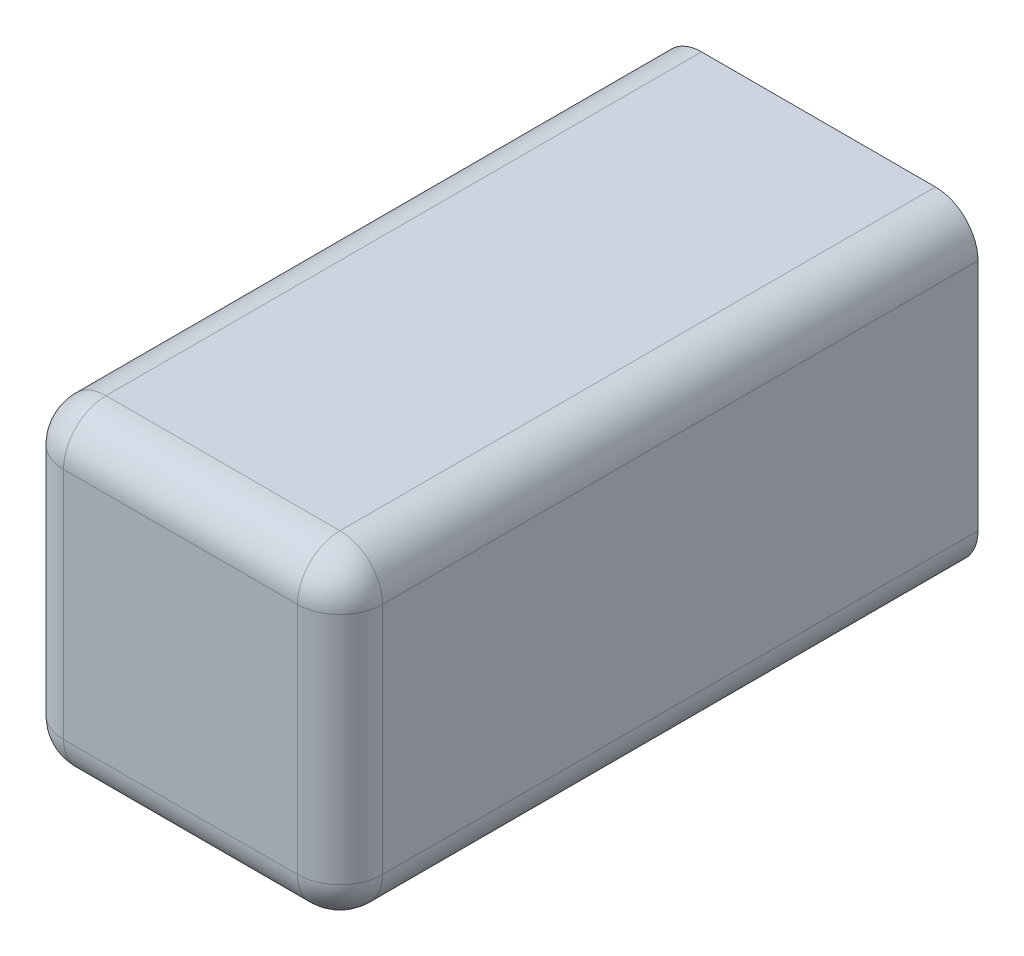
ISO-10303-21;
HEADER;
FILE_DESCRIPTION(('STEP AP214'),'2;1');
FILE_NAME('part.step','',(''),(''),'','','');
FILE_SCHEMA(('AUTOMOTIVE_DESIGN { 1 0 10303 214 1 1 1 1 }'));
ENDSEC;
DATA;
#1=APPLICATION_CONTEXT('core data for automotive mechanical design processes');
#2=APPLICATION_PROTOCOL_DEFINITION('international standard','automotive_design',2000,#1);
#3=PRODUCT_CONTEXT('',#1,'mechanical');
#4=PRODUCT('Part','Part','',(#3));
#5=PRODUCT_RELATED_PRODUCT_CATEGORY('part','',(#4));
#6=PRODUCT_DEFINITION_FORMATION('','',#4);
#7=PRODUCT_DEFINITION_CONTEXT('part definition',#1,'design');
#8=PRODUCT_DEFINITION('design','',#6,#7);
#9=PRODUCT_DEFINITION_SHAPE('','',#8);
#10=(LENGTH_UNIT() NAMED_UNIT(*) SI_UNIT(.MILLI.,.METRE.));
#11=(NAMED_UNIT(*) PLANE_ANGLE_UNIT() SI_UNIT($,.RADIAN.));
#12=(NAMED_UNIT(*) SI_UNIT($,.STERADIAN.) SOLID_ANGLE_UNIT());
#13=UNCERTAINTY_MEASURE_WITH_UNIT(LENGTH_MEASURE(1.E-05),#10,'distance_accuracy_value','');
#14=(GEOMETRIC_REPRESENTATION_CONTEXT(3) GLOBAL_UNCERTAINTY_ASSIGNED_CONTEXT((#13)) GLOBAL_UNIT_ASSIGNED_CONTEXT((#10,
#11,#12)) REPRESENTATION_CONTEXT('',''));
#15=CARTESIAN_POINT('',(0.,0.,0.));
#16=DIRECTION('',(0.,0.,1.));
#17=DIRECTION('',(1.,0.,0.));
#18=AXIS2_PLACEMENT_3D('',#15,#16,#17);
#19=CARTESIAN_POINT('',(0.,0.,0.));
#20=DIRECTION('',(0.,0.,1.));
#21=DIRECTION('',(1.,0.,0.));
#22=AXIS2_PLACEMENT_3D('',#19,#20,#21);
#23=PLANE('',#22);
#24=DIRECTION('',(1.,0.,0.));
#25=VECTOR('',#24,1.);
#26=CARTESIAN_POINT('',(-7.5,-7.5,0.));
#27=LINE('',#26,#25);
#28=CARTESIAN_POINT('',(-5.5,-7.5,0.));
#29=VERTEX_POINT('',#28);
#30=CARTESIAN_POINT('',(5.5,-7.5,0.));
#31=VERTEX_POINT('',#30);
#32=EDGE_CURVE('E174',#29,#31,#27,.T.);
#33=ORIENTED_EDGE('',*,*,#32,.F.);
#34=CARTESIAN_POINT('',(-5.5,-5.5,0.));
#35=DIRECTION('',(0.,0.,1.));
#36=DIRECTION('',(1.,0.,0.));
#37=AXIS2_PLACEMENT_3D('',#34,#35,#36);
#38=CIRCLE('',#37,2.);
#39=CARTESIAN_POINT('',(-7.5,-5.5,0.));
#40=VERTEX_POINT('',#39);
#41=EDGE_CURVE('E11',#29,#40,#38,.F.);
#42=ORIENTED_EDGE('',*,*,#41,.T.);
#43=DIRECTION('',(0.,-1.,0.));
#44=VECTOR('',#43,1.);
#45=CARTESIAN_POINT('',(-7.5,7.5,0.));
#46=LINE('',#45,#44);
#47=CARTESIAN_POINT('',(-7.5,5.5,0.));
#48=VERTEX_POINT('',#47);
#49=EDGE_CURVE('E172',#48,#40,#46,.T.);
#50=ORIENTED_EDGE('',*,*,#49,.F.);
#51=CARTESIAN_POINT('',(-5.5,5.5,0.));
#52=DIRECTION('',(0.,0.,1.));
#53=DIRECTION('',(1.,0.,0.));
#54=AXIS2_PLACEMENT_3D('',#51,#52,#53);
#55=CIRCLE('',#54,2.);
#56=CARTESIAN_POINT('',(-5.5,7.5,0.));
#57=VERTEX_POINT('',#56);
#58=EDGE_CURVE('E216',#48,#57,#55,.F.);
#59=ORIENTED_EDGE('',*,*,#58,.T.);
#60=DIRECTION('',(-1.,0.,0.));
#61=VECTOR('',#60,1.);
#62=CARTESIAN_POINT('',(-7.5,7.5,0.));
#63=LINE('',#62,#61);
#64=CARTESIAN_POINT('',(5.5,7.5,0.));
#65=VERTEX_POINT('',#64);
#66=EDGE_CURVE('E164',#65,#57,#63,.T.);
#67=ORIENTED_EDGE('',*,*,#66,.F.);
#68=CARTESIAN_POINT('',(5.5,5.5,0.));
#69=DIRECTION('',(0.,0.,1.));
#70=DIRECTION('',(1.,0.,0.));
#71=AXIS2_PLACEMENT_3D('',#68,#69,#70);
#72=CIRCLE('',#71,2.);
#73=CARTESIAN_POINT('',(7.5,5.5,0.));
#74=VERTEX_POINT('',#73);
#75=EDGE_CURVE('E218',#65,#74,#72,.F.);
#76=ORIENTED_EDGE('',*,*,#75,.T.);
#77=DIRECTION('',(0.,1.,0.));
#78=VECTOR('',#77,1.);
#79=CARTESIAN_POINT('',(7.5,7.5,0.));
#80=LINE('',#79,#78);
#81=CARTESIAN_POINT('',(7.5,-5.5,0.));
#82=VERTEX_POINT('',#81);
#83=EDGE_CURVE('E160',#82,#74,#80,.T.);
#84=ORIENTED_EDGE('',*,*,#83,.F.);
#85=CARTESIAN_POINT('',(5.5,-5.5,0.));
#86=DIRECTION('',(0.,0.,1.));
#87=DIRECTION('',(1.,0.,0.));
#88=AXIS2_PLACEMENT_3D('',#85,#86,#87);
#89=CIRCLE('',#88,2.);
#90=EDGE_CURVE('E44',#82,#31,#89,.F.);
#91=ORIENTED_EDGE('',*,*,#90,.T.);
#92=EDGE_LOOP('',(#33,#42,#50,#59,#67,#76,#84,#91));
#93=FACE_BOUND('',#92,.T.);
#94=DIRECTION('',(0.,1.,0.));
#95=VECTOR('',#94,1.);
#96=CARTESIAN_POINT('',(-3.5,0.,0.));
#97=LINE('',#96,#95);
#98=CARTESIAN_POINT('',(-3.5,-3.5,0.));
#99=VERTEX_POINT('',#98);
#100=CARTESIAN_POINT('',(-3.5,3.5,0.));
#101=VERTEX_POINT('',#100);
#102=EDGE_CURVE('E182',#99,#101,#97,.T.);
#103=ORIENTED_EDGE('',*,*,#102,.F.);
#104=DIRECTION('',(-1.,0.,0.));
#105=VECTOR('',#104,1.);
#106=CARTESIAN_POINT('',(0.,-3.5,0.));
#107=LINE('',#106,#105);
#108=CARTESIAN_POINT('',(3.5,-3.5,0.));
#109=VERTEX_POINT('',#108);
#110=EDGE_CURVE('E159',#109,#99,#107,.T.);
#111=ORIENTED_EDGE('',*,*,#110,.F.);
#112=DIRECTION('',(0.,-1.,0.));
#113=VECTOR('',#112,1.);
#114=CARTESIAN_POINT('',(3.5,0.,0.));
#115=LINE('',#114,#113);
#116=CARTESIAN_POINT('',(3.5,3.5,0.));
#117=VERTEX_POINT('',#116);
#118=EDGE_CURVE('E179',#117,#109,#115,.T.);
#119=ORIENTED_EDGE('',*,*,#118,.F.);
#120=DIRECTION('',(1.,0.,0.));
#121=VECTOR('',#120,1.);
#122=CARTESIAN_POINT('',(0.,3.5,0.));
#123=LINE('',#122,#121);
#124=EDGE_CURVE('E177',#101,#117,#123,.T.);
#125=ORIENTED_EDGE('',*,*,#124,.F.);
#126=EDGE_LOOP('',(#103,#111,#119,#125));
#127=FACE_BOUND('',#126,.T.);
#128=ADVANCED_FACE('F35',(#93,#127),#23,.F.);
#129=CARTESIAN_POINT('',(7.5,7.5,30.));
#130=DIRECTION('',(-1.,0.,0.));
#131=DIRECTION('',(0.,-1.,0.));
#132=AXIS2_PLACEMENT_3D('',#129,#130,#131);
#133=PLANE('',#132);
#134=DIRECTION('',(0.,1.,0.));
#135=VECTOR('',#134,1.);
#136=CARTESIAN_POINT('',(7.5,-7.5,28.));
#137=LINE('',#136,#135);
#138=CARTESIAN_POINT('',(7.5,5.5,28.));
#139=VERTEX_POINT('',#138);
#140=CARTESIAN_POINT('',(7.5,-5.5,28.));
#141=VERTEX_POINT('',#140);
#142=EDGE_CURVE('E202',#139,#141,#137,.F.);
#143=ORIENTED_EDGE('',*,*,#142,.T.);
#144=DIRECTION('',(0.,0.,-1.));
#145=VECTOR('',#144,1.);
#146=CARTESIAN_POINT('',(7.5,-5.5,30.));
#147=LINE('',#146,#145);
#148=EDGE_CURVE('E204',#141,#82,#147,.T.);
#149=ORIENTED_EDGE('',*,*,#148,.T.);
#150=ORIENTED_EDGE('',*,*,#83,.T.);
#151=DIRECTION('',(0.,0.,-1.));
#152=VECTOR('',#151,1.);
#153=CARTESIAN_POINT('',(7.5,5.5,30.));
#154=LINE('',#153,#152);
#155=EDGE_CURVE('E200',#74,#139,#154,.F.);
#156=ORIENTED_EDGE('',*,*,#155,.T.);
#157=EDGE_LOOP('',(#143,#149,#150,#156));
#158=FACE_BOUND('',#157,.T.);
#159=ADVANCED_FACE('F311',(#158),#133,.F.);
#160=CARTESIAN_POINT('',(-7.5,7.5,30.));
#161=DIRECTION('',(0.,-1.,0.));
#162=DIRECTION('',(0.,0.,-1.));
#163=AXIS2_PLACEMENT_3D('',#160,#161,#162);
#164=PLANE('',#163);
#165=DIRECTION('',(-1.,0.,0.));
#166=VECTOR('',#165,1.);
#167=CARTESIAN_POINT('',(7.5,7.5,28.));
#168=LINE('',#167,#166);
#169=CARTESIAN_POINT('',(-5.5,7.5,28.));
#170=VERTEX_POINT('',#169);
#171=CARTESIAN_POINT('',(5.5,7.5,28.));
#172=VERTEX_POINT('',#171);
#173=EDGE_CURVE('E195',#170,#172,#168,.F.);
#174=ORIENTED_EDGE('',*,*,#173,.T.);
#175=DIRECTION('',(0.,0.,-1.));
#176=VECTOR('',#175,1.);
#177=CARTESIAN_POINT('',(5.5,7.5,30.));
#178=LINE('',#177,#176);
#179=EDGE_CURVE('E198',#172,#65,#178,.T.);
#180=ORIENTED_EDGE('',*,*,#179,.T.);
#181=ORIENTED_EDGE('',*,*,#66,.T.);
#182=DIRECTION('',(0.,0.,-1.));
#183=VECTOR('',#182,1.);
#184=CARTESIAN_POINT('',(-5.5,7.5,30.));
#185=LINE('',#184,#183);
#186=EDGE_CURVE('E193',#57,#170,#185,.F.);
#187=ORIENTED_EDGE('',*,*,#186,.T.);
#188=EDGE_LOOP('',(#174,#180,#181,#187));
#189=FACE_BOUND('',#188,.T.);
#190=ADVANCED_FACE('F302',(#189),#164,.F.);
#191=CARTESIAN_POINT('',(-7.5,7.5,30.));
#192=DIRECTION('',(1.,0.,0.));
#193=DIRECTION('',(0.,1.,0.));
#194=AXIS2_PLACEMENT_3D('',#191,#192,#193);
#195=PLANE('',#194);
#196=ORIENTED_EDGE('',*,*,#49,.T.);
#197=DIRECTION('',(0.,0.,-1.));
#198=VECTOR('',#197,1.);
#199=CARTESIAN_POINT('',(-7.5,-5.5,30.));
#200=LINE('',#199,#198);
#201=CARTESIAN_POINT('',(-7.5,-5.5,28.));
#202=VERTEX_POINT('',#201);
#203=EDGE_CURVE('E52',#40,#202,#200,.F.);
#204=ORIENTED_EDGE('',*,*,#203,.T.);
#205=DIRECTION('',(0.,-1.,0.));
#206=VECTOR('',#205,1.);
#207=CARTESIAN_POINT('',(-7.5,7.5,28.));
#208=LINE('',#207,#206);
#209=CARTESIAN_POINT('',(-7.5,5.5,28.));
#210=VERTEX_POINT('',#209);
#211=EDGE_CURVE('E57',#202,#210,#208,.F.);
#212=ORIENTED_EDGE('',*,*,#211,.T.);
#213=DIRECTION('',(0.,0.,-1.));
#214=VECTOR('',#213,1.);
#215=CARTESIAN_POINT('',(-7.5,5.5,30.));
#216=LINE('',#215,#214);
#217=EDGE_CURVE('E212',#210,#48,#216,.T.);
#218=ORIENTED_EDGE('',*,*,#217,.T.);
#219=EDGE_LOOP('',(#196,#204,#212,#218));
#220=FACE_BOUND('',#219,.T.);
#221=ADVANCED_FACE('F287',(#220),#195,.F.);
#222=CARTESIAN_POINT('',(-7.5,-7.5,30.));
#223=DIRECTION('',(0.,1.,0.));
#224=DIRECTION('',(0.,0.,1.));
#225=AXIS2_PLACEMENT_3D('',#222,#223,#224);
#226=PLANE('',#225);
#227=DIRECTION('',(1.,0.,0.));
#228=VECTOR('',#227,1.);
#229=CARTESIAN_POINT('',(-7.5,-7.5,28.));
#230=LINE('',#229,#228);
#231=CARTESIAN_POINT('',(5.5,-7.5,28.));
#232=VERTEX_POINT('',#231);
#233=CARTESIAN_POINT('',(-5.5,-7.5,28.));
#234=VERTEX_POINT('',#233);
#235=EDGE_CURVE('E208',#232,#234,#230,.F.);
#236=ORIENTED_EDGE('',*,*,#235,.T.);
#237=DIRECTION('',(0.,0.,-1.));
#238=VECTOR('',#237,1.);
#239=CARTESIAN_POINT('',(-5.5,-7.5,30.));
#240=LINE('',#239,#238);
#241=EDGE_CURVE('E210',#234,#29,#240,.T.);
#242=ORIENTED_EDGE('',*,*,#241,.T.);
#243=ORIENTED_EDGE('',*,*,#32,.T.);
#244=DIRECTION('',(0.,0.,-1.));
#245=VECTOR('',#244,1.);
#246=CARTESIAN_POINT('',(5.5,-7.5,30.));
#247=LINE('',#246,#245);
#248=EDGE_CURVE('E206',#31,#232,#247,.F.);
#249=ORIENTED_EDGE('',*,*,#248,.T.);
#250=EDGE_LOOP('',(#236,#242,#243,#249));
#251=FACE_BOUND('',#250,.T.);
#252=ADVANCED_FACE('F277',(#251),#226,.F.);
#253=CARTESIAN_POINT('',(0.,0.,30.));
#254=DIRECTION('',(0.,0.,1.));
#255=DIRECTION('',(1.,0.,0.));
#256=AXIS2_PLACEMENT_3D('',#253,#254,#255);
#257=PLANE('',#256);
#258=DIRECTION('',(0.,1.,0.));
#259=VECTOR('',#258,1.);
#260=CARTESIAN_POINT('',(5.5,7.5,30.));
#261=LINE('',#260,#259);
#262=CARTESIAN_POINT('',(5.5,-5.5,30.));
#263=VERTEX_POINT('',#262);
#264=CARTESIAN_POINT('',(5.5,5.5,30.));
#265=VERTEX_POINT('',#264);
#266=EDGE_CURVE('E188',#263,#265,#261,.T.);
#267=ORIENTED_EDGE('',*,*,#266,.T.);
#268=DIRECTION('',(-1.,0.,0.));
#269=VECTOR('',#268,1.);
#270=CARTESIAN_POINT('',(-7.5,5.5,30.));
#271=LINE('',#270,#269);
#272=CARTESIAN_POINT('',(-5.5,5.5,30.));
#273=VERTEX_POINT('',#272);
#274=EDGE_CURVE('E190',#265,#273,#271,.T.);
#275=ORIENTED_EDGE('',*,*,#274,.T.);
#276=DIRECTION('',(0.,-1.,0.));
#277=VECTOR('',#276,1.);
#278=CARTESIAN_POINT('',(-5.5,-7.5,30.));
#279=LINE('',#278,#277);
#280=CARTESIAN_POINT('',(-5.5,-5.5,30.));
#281=VERTEX_POINT('',#280);
#282=EDGE_CURVE('E184',#273,#281,#279,.T.);
#283=ORIENTED_EDGE('',*,*,#282,.T.);
#284=DIRECTION('',(1.,0.,0.));
#285=VECTOR('',#284,1.);
#286=CARTESIAN_POINT('',(7.5,-5.5,30.));
#287=LINE('',#286,#285);
#288=EDGE_CURVE('E186',#281,#263,#287,.T.);
#289=ORIENTED_EDGE('',*,*,#288,.T.);
#290=EDGE_LOOP('',(#267,#275,#283,#289));
#291=FACE_BOUND('',#290,.T.);
#292=ADVANCED_FACE('F267',(#291),#257,.T.);
#293=CARTESIAN_POINT('',(-3.5,3.5,25.));
#294=DIRECTION('',(1.,0.,0.));
#295=DIRECTION('',(0.,1.,0.));
#296=AXIS2_PLACEMENT_3D('',#293,#294,#295);
#297=PLANE('',#296);
#298=ORIENTED_EDGE('',*,*,#102,.T.);
#299=DIRECTION('',(0.,0.,-1.));
#300=VECTOR('',#299,1.);
#301=CARTESIAN_POINT('',(-3.5,3.5,25.));
#302=LINE('',#301,#300);
#303=CARTESIAN_POINT('',(-3.5,3.5,25.));
#304=VERTEX_POINT('',#303);
#305=EDGE_CURVE('E155',#304,#101,#302,.T.);
#306=ORIENTED_EDGE('',*,*,#305,.F.);
#307=DIRECTION('',(0.,-1.,0.));
#308=VECTOR('',#307,1.);
#309=CARTESIAN_POINT('',(-3.5,3.5,25.));
#310=LINE('',#309,#308);
#311=CARTESIAN_POINT('',(-3.5,-3.5,25.));
#312=VERTEX_POINT('',#311);
#313=EDGE_CURVE('E141',#304,#312,#310,.T.);
#314=ORIENTED_EDGE('',*,*,#313,.T.);
#315=DIRECTION('',(0.,0.,-1.));
#316=VECTOR('',#315,1.);
#317=CARTESIAN_POINT('',(-3.5,-3.5,25.));
#318=LINE('',#317,#316);
#319=EDGE_CURVE('E153',#312,#99,#318,.T.);
#320=ORIENTED_EDGE('',*,*,#319,.T.);
#321=EDGE_LOOP('',(#298,#306,#314,#320));
#322=FACE_BOUND('',#321,.T.);
#323=ADVANCED_FACE('F152',(#322),#297,.T.);
#324=CARTESIAN_POINT('',(3.5,-3.5,25.));
#325=DIRECTION('',(0.,1.,0.));
#326=DIRECTION('',(0.,0.,1.));
#327=AXIS2_PLACEMENT_3D('',#324,#325,#326);
#328=PLANE('',#327);
#329=ORIENTED_EDGE('',*,*,#110,.T.);
#330=ORIENTED_EDGE('',*,*,#319,.F.);
#331=DIRECTION('',(1.,0.,0.));
#332=VECTOR('',#331,1.);
#333=CARTESIAN_POINT('',(3.5,-3.5,25.));
#334=LINE('',#333,#332);
#335=CARTESIAN_POINT('',(3.5,-3.5,25.));
#336=VERTEX_POINT('',#335);
#337=EDGE_CURVE('E137',#312,#336,#334,.T.);
#338=ORIENTED_EDGE('',*,*,#337,.T.);
#339=DIRECTION('',(0.,0.,-1.));
#340=VECTOR('',#339,1.);
#341=CARTESIAN_POINT('',(3.5,-3.5,25.));
#342=LINE('',#341,#340);
#343=EDGE_CURVE('E161',#336,#109,#342,.T.);
#344=ORIENTED_EDGE('',*,*,#343,.T.);
#345=EDGE_LOOP('',(#329,#330,#338,#344));
#346=FACE_BOUND('',#345,.T.);
#347=ADVANCED_FACE('F157',(#346),#328,.T.);
#348=CARTESIAN_POINT('',(3.5,3.5,25.));
#349=DIRECTION('',(-1.,0.,0.));
#350=DIRECTION('',(0.,-1.,0.));
#351=AXIS2_PLACEMENT_3D('',#348,#349,#350);
#352=PLANE('',#351);
#353=ORIENTED_EDGE('',*,*,#118,.T.);
#354=ORIENTED_EDGE('',*,*,#343,.F.);
#355=DIRECTION('',(0.,1.,0.));
#356=VECTOR('',#355,1.);
#357=CARTESIAN_POINT('',(3.5,3.5,25.));
#358=LINE('',#357,#356);
#359=CARTESIAN_POINT('',(3.5,3.5,25.));
#360=VERTEX_POINT('',#359);
#361=EDGE_CURVE('E142',#336,#360,#358,.T.);
#362=ORIENTED_EDGE('',*,*,#361,.T.);
#363=DIRECTION('',(0.,0.,-1.));
#364=VECTOR('',#363,1.);
#365=CARTESIAN_POINT('',(3.5,3.5,25.));
#366=LINE('',#365,#364);
#367=EDGE_CURVE('E166',#360,#117,#366,.T.);
#368=ORIENTED_EDGE('',*,*,#367,.T.);
#369=EDGE_LOOP('',(#353,#354,#362,#368));
#370=FACE_BOUND('',#369,.T.);
#371=ADVANCED_FACE('F440',(#370),#352,.T.);
#372=CARTESIAN_POINT('',(3.5,3.5,25.));
#373=DIRECTION('',(0.,-1.,0.));
#374=DIRECTION('',(0.,0.,-1.));
#375=AXIS2_PLACEMENT_3D('',#372,#373,#374);
#376=PLANE('',#375);
#377=ORIENTED_EDGE('',*,*,#124,.T.);
#378=ORIENTED_EDGE('',*,*,#367,.F.);
#379=DIRECTION('',(-1.,0.,0.));
#380=VECTOR('',#379,1.);
#381=CARTESIAN_POINT('',(3.5,3.5,25.));
#382=LINE('',#381,#380);
#383=EDGE_CURVE('E507',#360,#304,#382,.T.);
#384=ORIENTED_EDGE('',*,*,#383,.T.);
#385=ORIENTED_EDGE('',*,*,#305,.T.);
#386=EDGE_LOOP('',(#377,#378,#384,#385));
#387=FACE_BOUND('',#386,.T.);
#388=ADVANCED_FACE('F318',(#387),#376,.T.);
#389=CARTESIAN_POINT('',(0.,0.,25.));
#390=DIRECTION('',(0.,0.,-1.));
#391=DIRECTION('',(-1.,0.,0.));
#392=AXIS2_PLACEMENT_3D('',#389,#390,#391);
#393=PLANE('',#392);
#394=ORIENTED_EDGE('',*,*,#313,.F.);
#395=ORIENTED_EDGE('',*,*,#383,.F.);
#396=ORIENTED_EDGE('',*,*,#361,.F.);
#397=ORIENTED_EDGE('',*,*,#337,.F.);
#398=EDGE_LOOP('',(#394,#395,#396,#397));
#399=FACE_BOUND('',#398,.T.);
#400=ADVANCED_FACE('F139',(#399),#393,.T.);
#401=CARTESIAN_POINT('',(5.5,-5.5,30.));
#402=DIRECTION('',(0.,0.,-1.));
#403=DIRECTION('',(-1.,0.,0.));
#404=AXIS2_PLACEMENT_3D('',#401,#402,#403);
#405=CYLINDRICAL_SURFACE('',#404,2.);
#406=ORIENTED_EDGE('',*,*,#90,.F.);
#407=ORIENTED_EDGE('',*,*,#148,.F.);
#408=CARTESIAN_POINT('',(5.5,-5.5,28.));
#409=DIRECTION('',(0.,0.,1.));
#410=DIRECTION('',(1.,0.,0.));
#411=AXIS2_PLACEMENT_3D('',#408,#409,#410);
#412=CIRCLE('',#411,2.);
#413=EDGE_CURVE('E39',#232,#141,#412,.T.);
#414=ORIENTED_EDGE('',*,*,#413,.F.);
#415=ORIENTED_EDGE('',*,*,#248,.F.);
#416=EDGE_LOOP('',(#406,#407,#414,#415));
#417=FACE_BOUND('',#416,.T.);
#418=ADVANCED_FACE('F37',(#417),#405,.T.);
#419=CARTESIAN_POINT('',(0.,-5.5,28.));
#420=DIRECTION('',(-1.,0.,0.));
#421=DIRECTION('',(0.,0.,1.));
#422=AXIS2_PLACEMENT_3D('',#419,#420,#421);
#423=CYLINDRICAL_SURFACE('',#422,2.);
#424=CARTESIAN_POINT('',(-5.5,-5.5,28.));
#425=DIRECTION('',(-1.,0.,0.));
#426=DIRECTION('',(0.,0.,1.));
#427=AXIS2_PLACEMENT_3D('',#424,#425,#426);
#428=CIRCLE('',#427,2.);
#429=EDGE_CURVE('E246',#234,#281,#428,.T.);
#430=ORIENTED_EDGE('',*,*,#429,.F.);
#431=ORIENTED_EDGE('',*,*,#235,.F.);
#432=CARTESIAN_POINT('',(5.5,-5.5,28.));
#433=DIRECTION('',(1.,0.,0.));
#434=DIRECTION('',(0.,1.,0.));
#435=AXIS2_PLACEMENT_3D('',#432,#433,#434);
#436=CIRCLE('',#435,2.);
#437=EDGE_CURVE('E248',#263,#232,#436,.T.);
#438=ORIENTED_EDGE('',*,*,#437,.F.);
#439=ORIENTED_EDGE('',*,*,#288,.F.);
#440=EDGE_LOOP('',(#430,#431,#438,#439));
#441=FACE_BOUND('',#440,.T.);
#442=ADVANCED_FACE('F274',(#441),#423,.T.);
#443=CARTESIAN_POINT('',(-5.5,-5.5,30.));
#444=DIRECTION('',(0.,0.,-1.));
#445=DIRECTION('',(-1.,0.,0.));
#446=AXIS2_PLACEMENT_3D('',#443,#444,#445);
#447=CYLINDRICAL_SURFACE('',#446,2.);
#448=ORIENTED_EDGE('',*,*,#41,.F.);
#449=ORIENTED_EDGE('',*,*,#241,.F.);
#450=CARTESIAN_POINT('',(-5.5,-5.5,28.));
#451=DIRECTION('',(0.,0.,1.));
#452=DIRECTION('',(1.,0.,0.));
#453=AXIS2_PLACEMENT_3D('',#450,#451,#452);
#454=CIRCLE('',#453,2.);
#455=EDGE_CURVE('E243',#202,#234,#454,.T.);
#456=ORIENTED_EDGE('',*,*,#455,.F.);
#457=ORIENTED_EDGE('',*,*,#203,.F.);
#458=EDGE_LOOP('',(#448,#449,#456,#457));
#459=FACE_BOUND('',#458,.T.);
#460=ADVANCED_FACE('F281',(#459),#447,.T.);
#461=CARTESIAN_POINT('',(5.5,-5.5,28.));
#462=DIRECTION('',(0.,0.,1.));
#463=DIRECTION('',(1.,0.,0.));
#464=AXIS2_PLACEMENT_3D('',#461,#462,#463);
#465=SPHERICAL_SURFACE('',#464,2.);
#466=ORIENTED_EDGE('',*,*,#437,.T.);
#467=ORIENTED_EDGE('',*,*,#413,.T.);
#468=CARTESIAN_POINT('',(5.5,-5.5,28.));
#469=DIRECTION('',(0.,-1.,0.));
#470=DIRECTION('',(0.,0.,-1.));
#471=AXIS2_PLACEMENT_3D('',#468,#469,#470);
#472=CIRCLE('',#471,2.);
#473=EDGE_CURVE('E240',#263,#141,#472,.F.);
#474=ORIENTED_EDGE('',*,*,#473,.F.);
#475=EDGE_LOOP('',(#466,#467,#474));
#476=FACE_BOUND('',#475,.T.);
#477=ADVANCED_FACE('F255',(#476),#465,.T.);
#478=CARTESIAN_POINT('',(-5.5,-5.5,28.));
#479=DIRECTION('',(0.,0.,1.));
#480=DIRECTION('',(1.,0.,0.));
#481=AXIS2_PLACEMENT_3D('',#478,#479,#480);
#482=SPHERICAL_SURFACE('',#481,2.);
#483=ORIENTED_EDGE('',*,*,#455,.T.);
#484=ORIENTED_EDGE('',*,*,#429,.T.);
#485=CARTESIAN_POINT('',(-5.5,-5.5,28.));
#486=DIRECTION('',(0.,-1.,0.));
#487=DIRECTION('',(0.,0.,-1.));
#488=AXIS2_PLACEMENT_3D('',#485,#486,#487);
#489=CIRCLE('',#488,2.);
#490=EDGE_CURVE('E237',#202,#281,#489,.F.);
#491=ORIENTED_EDGE('',*,*,#490,.F.);
#492=EDGE_LOOP('',(#483,#484,#491));
#493=FACE_BOUND('',#492,.T.);
#494=ADVANCED_FACE('F351',(#493),#482,.T.);
#495=CARTESIAN_POINT('',(5.5,5.5,30.));
#496=DIRECTION('',(0.,0.,-1.));
#497=DIRECTION('',(-1.,0.,0.));
#498=AXIS2_PLACEMENT_3D('',#495,#496,#497);
#499=CYLINDRICAL_SURFACE('',#498,2.);
#500=ORIENTED_EDGE('',*,*,#75,.F.);
#501=ORIENTED_EDGE('',*,*,#179,.F.);
#502=CARTESIAN_POINT('',(5.5,5.5,28.));
#503=DIRECTION('',(0.,0.,1.));
#504=DIRECTION('',(1.,0.,0.));
#505=AXIS2_PLACEMENT_3D('',#502,#503,#504);
#506=CIRCLE('',#505,2.);
#507=EDGE_CURVE('E234',#139,#172,#506,.T.);
#508=ORIENTED_EDGE('',*,*,#507,.F.);
#509=ORIENTED_EDGE('',*,*,#155,.F.);
#510=EDGE_LOOP('',(#500,#501,#508,#509));
#511=FACE_BOUND('',#510,.T.);
#512=ADVANCED_FACE('F309',(#511),#499,.T.);
#513=CARTESIAN_POINT('',(5.5,0.,28.));
#514=DIRECTION('',(0.,-1.,0.));
#515=DIRECTION('',(1.,0.,0.));
#516=AXIS2_PLACEMENT_3D('',#513,#514,#515);
#517=CYLINDRICAL_SURFACE('',#516,2.);
#518=ORIENTED_EDGE('',*,*,#473,.T.);
#519=ORIENTED_EDGE('',*,*,#142,.F.);
#520=CARTESIAN_POINT('',(5.5,5.5,28.));
#521=DIRECTION('',(0.,1.,0.));
#522=DIRECTION('',(0.,0.,1.));
#523=AXIS2_PLACEMENT_3D('',#520,#521,#522);
#524=CIRCLE('',#523,2.);
#525=EDGE_CURVE('E231',#265,#139,#524,.T.);
#526=ORIENTED_EDGE('',*,*,#525,.F.);
#527=ORIENTED_EDGE('',*,*,#266,.F.);
#528=EDGE_LOOP('',(#518,#519,#526,#527));
#529=FACE_BOUND('',#528,.T.);
#530=ADVANCED_FACE('F262',(#529),#517,.T.);
#531=CARTESIAN_POINT('',(-5.5,0.,28.));
#532=DIRECTION('',(0.,1.,0.));
#533=DIRECTION('',(-1.,0.,0.));
#534=AXIS2_PLACEMENT_3D('',#531,#532,#533);
#535=CYLINDRICAL_SURFACE('',#534,2.);
#536=ORIENTED_EDGE('',*,*,#490,.T.);
#537=ORIENTED_EDGE('',*,*,#282,.F.);
#538=CARTESIAN_POINT('',(-5.5,5.5,28.));
#539=DIRECTION('',(0.,1.,0.));
#540=DIRECTION('',(0.,0.,1.));
#541=AXIS2_PLACEMENT_3D('',#538,#539,#540);
#542=CIRCLE('',#541,2.);
#543=EDGE_CURVE('E228',#210,#273,#542,.T.);
#544=ORIENTED_EDGE('',*,*,#543,.F.);
#545=ORIENTED_EDGE('',*,*,#211,.F.);
#546=EDGE_LOOP('',(#536,#537,#544,#545));
#547=FACE_BOUND('',#546,.T.);
#548=ADVANCED_FACE('F295',(#547),#535,.T.);
#549=CARTESIAN_POINT('',(-5.5,5.5,30.));
#550=DIRECTION('',(0.,0.,-1.));
#551=DIRECTION('',(-1.,0.,0.));
#552=AXIS2_PLACEMENT_3D('',#549,#550,#551);
#553=CYLINDRICAL_SURFACE('',#552,2.);
#554=ORIENTED_EDGE('',*,*,#58,.F.);
#555=ORIENTED_EDGE('',*,*,#217,.F.);
#556=CARTESIAN_POINT('',(-5.5,5.5,28.));
#557=DIRECTION('',(0.,0.,1.));
#558=DIRECTION('',(1.,0.,0.));
#559=AXIS2_PLACEMENT_3D('',#556,#557,#558);
#560=CIRCLE('',#559,2.);
#561=EDGE_CURVE('E225',#170,#210,#560,.T.);
#562=ORIENTED_EDGE('',*,*,#561,.F.);
#563=ORIENTED_EDGE('',*,*,#186,.F.);
#564=EDGE_LOOP('',(#554,#555,#562,#563));
#565=FACE_BOUND('',#564,.T.);
#566=ADVANCED_FACE('F291',(#565),#553,.T.);
#567=CARTESIAN_POINT('',(5.5,5.5,28.));
#568=DIRECTION('',(0.,0.,1.));
#569=DIRECTION('',(1.,0.,0.));
#570=AXIS2_PLACEMENT_3D('',#567,#568,#569);
#571=SPHERICAL_SURFACE('',#570,2.);
#572=ORIENTED_EDGE('',*,*,#525,.T.);
#573=ORIENTED_EDGE('',*,*,#507,.T.);
#574=CARTESIAN_POINT('',(5.5,5.5,28.));
#575=DIRECTION('',(1.,0.,0.));
#576=DIRECTION('',(0.,0.,-1.));
#577=AXIS2_PLACEMENT_3D('',#574,#575,#576);
#578=CIRCLE('',#577,2.);
#579=EDGE_CURVE('E223',#265,#172,#578,.F.);
#580=ORIENTED_EDGE('',*,*,#579,.F.);
#581=EDGE_LOOP('',(#572,#573,#580));
#582=FACE_BOUND('',#581,.T.);
#583=ADVANCED_FACE('F339',(#582),#571,.T.);
#584=CARTESIAN_POINT('',(-5.5,5.5,28.));
#585=DIRECTION('',(0.,0.,1.));
#586=DIRECTION('',(1.,0.,0.));
#587=AXIS2_PLACEMENT_3D('',#584,#585,#586);
#588=SPHERICAL_SURFACE('',#587,2.);
#589=ORIENTED_EDGE('',*,*,#561,.T.);
#590=ORIENTED_EDGE('',*,*,#543,.T.);
#591=CARTESIAN_POINT('',(-5.5,5.5,28.));
#592=DIRECTION('',(-1.,0.,0.));
#593=DIRECTION('',(0.,0.,1.));
#594=AXIS2_PLACEMENT_3D('',#591,#592,#593);
#595=CIRCLE('',#594,2.);
#596=EDGE_CURVE('E221',#170,#273,#595,.F.);
#597=ORIENTED_EDGE('',*,*,#596,.F.);
#598=EDGE_LOOP('',(#589,#590,#597));
#599=FACE_BOUND('',#598,.T.);
#600=ADVANCED_FACE('F298',(#599),#588,.T.);
#601=CARTESIAN_POINT('',(0.,5.5,28.));
#602=DIRECTION('',(1.,0.,0.));
#603=DIRECTION('',(0.,0.,-1.));
#604=AXIS2_PLACEMENT_3D('',#601,#602,#603);
#605=CYLINDRICAL_SURFACE('',#604,2.);
#606=ORIENTED_EDGE('',*,*,#579,.T.);
#607=ORIENTED_EDGE('',*,*,#173,.F.);
#608=ORIENTED_EDGE('',*,*,#596,.T.);
#609=ORIENTED_EDGE('',*,*,#274,.F.);
#610=EDGE_LOOP('',(#606,#607,#608,#609));
#611=FACE_BOUND('',#610,.T.);
#612=ADVANCED_FACE('F300',(#611),#605,.T.);
#613=CLOSED_SHELL('',(#128,#159,#190,#221,#252,#292,#323,#347,#371,#388,#400,#418,#442,#460,
#477,#494,#512,#530,#548,#566,#583,#600,#612));
#614=MANIFOLD_SOLID_BREP('B2',#613);
#615=ADVANCED_BREP_SHAPE_REPRESENTATION('',(#18,#614),#14);
#616=SHAPE_DEFINITION_REPRESENTATION(#9,#615);
ENDSEC;
END-ISO-10303-21;
